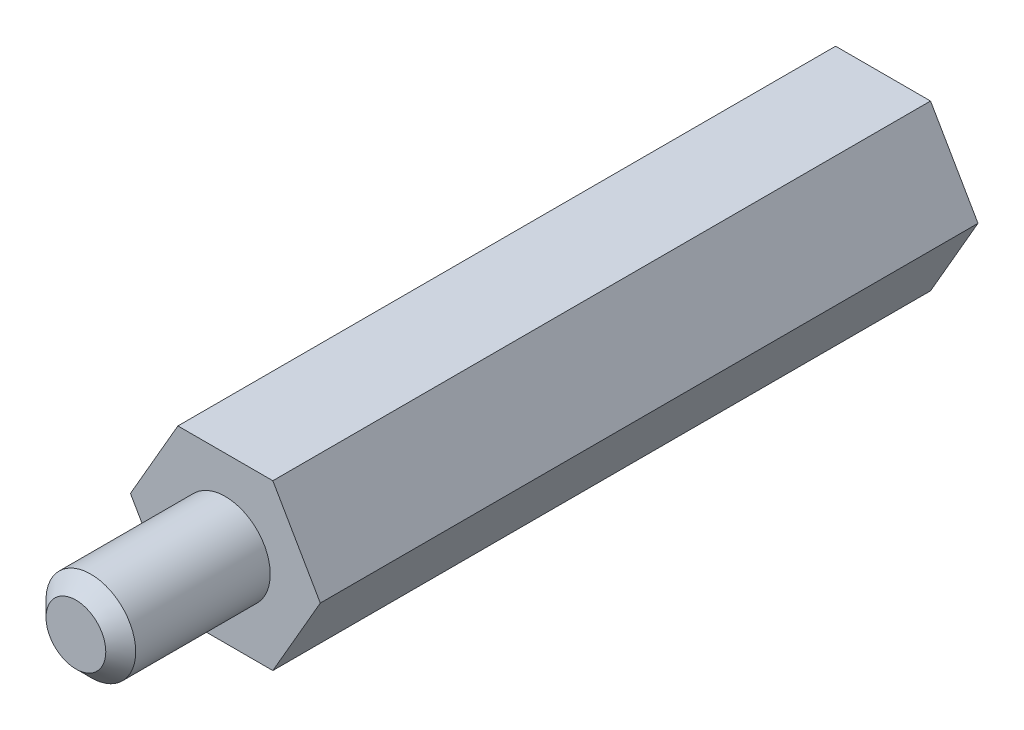
ISO-10303-21;
HEADER;
FILE_DESCRIPTION(('STEP AP214'),'2;1');
FILE_NAME('part.step','',(''),(''),'','','');
FILE_SCHEMA(('AUTOMOTIVE_DESIGN { 1 0 10303 214 1 1 1 1 }'));
ENDSEC;
DATA;
#1=APPLICATION_CONTEXT('core data for automotive mechanical design processes');
#2=APPLICATION_PROTOCOL_DEFINITION('international standard','automotive_design',2000,#1);
#3=PRODUCT_CONTEXT('',#1,'mechanical');
#4=PRODUCT('Part','Part','',(#3));
#5=PRODUCT_RELATED_PRODUCT_CATEGORY('part','',(#4));
#6=PRODUCT_DEFINITION_FORMATION('','',#4);
#7=PRODUCT_DEFINITION_CONTEXT('part definition',#1,'design');
#8=PRODUCT_DEFINITION('design','',#6,#7);
#9=PRODUCT_DEFINITION_SHAPE('','',#8);
#10=(LENGTH_UNIT() NAMED_UNIT(*) SI_UNIT(.MILLI.,.METRE.));
#11=(NAMED_UNIT(*) PLANE_ANGLE_UNIT() SI_UNIT($,.RADIAN.));
#12=(NAMED_UNIT(*) SI_UNIT($,.STERADIAN.) SOLID_ANGLE_UNIT());
#13=UNCERTAINTY_MEASURE_WITH_UNIT(LENGTH_MEASURE(1.E-05),#10,'distance_accuracy_value','');
#14=(GEOMETRIC_REPRESENTATION_CONTEXT(3) GLOBAL_UNCERTAINTY_ASSIGNED_CONTEXT((#13)) GLOBAL_UNIT_ASSIGNED_CONTEXT((#10,
#11,#12)) REPRESENTATION_CONTEXT('',''));
#15=CARTESIAN_POINT('',(0.,0.,0.));
#16=DIRECTION('',(0.,0.,1.));
#17=DIRECTION('',(1.,0.,0.));
#18=AXIS2_PLACEMENT_3D('',#15,#16,#17);
#19=CARTESIAN_POINT('',(1.58771324027146,-2.75000000000001,22.));
#20=DIRECTION('',(-0.866025403784438,0.5,0.));
#21=DIRECTION('',(-0.5,-0.866025403784439,0.));
#22=AXIS2_PLACEMENT_3D('',#19,#20,#21);
#23=PLANE('',#22);
#24=DIRECTION('',(0.5,0.866025403784439,0.));
#25=VECTOR('',#24,1.);
#26=CARTESIAN_POINT('',(1.58771324027146,-2.75000000000001,0.));
#27=LINE('',#26,#25);
#28=CARTESIAN_POINT('',(1.58771324027146,-2.75000000000001,0.));
#29=VERTEX_POINT('',#28);
#30=CARTESIAN_POINT('',(3.17542648054294,0.,0.));
#31=VERTEX_POINT('',#30);
#32=EDGE_CURVE('E122',#29,#31,#27,.T.);
#33=ORIENTED_EDGE('',*,*,#32,.T.);
#34=DIRECTION('',(0.,0.,-1.));
#35=VECTOR('',#34,1.);
#36=CARTESIAN_POINT('',(3.17542648054294,0.,22.));
#37=LINE('',#36,#35);
#38=CARTESIAN_POINT('',(3.17542648054294,0.,22.));
#39=VERTEX_POINT('',#38);
#40=EDGE_CURVE('E140',#39,#31,#37,.T.);
#41=ORIENTED_EDGE('',*,*,#40,.F.);
#42=DIRECTION('',(0.5,0.866025403784439,0.));
#43=VECTOR('',#42,1.);
#44=CARTESIAN_POINT('',(1.58771324027146,-2.75000000000001,22.));
#45=LINE('',#44,#43);
#46=CARTESIAN_POINT('',(1.58771324027146,-2.75000000000001,22.));
#47=VERTEX_POINT('',#46);
#48=EDGE_CURVE('E133',#47,#39,#45,.T.);
#49=ORIENTED_EDGE('',*,*,#48,.F.);
#50=DIRECTION('',(0.,0.,-1.));
#51=VECTOR('',#50,1.);
#52=CARTESIAN_POINT('',(1.58771324027146,-2.75000000000001,22.));
#53=LINE('',#52,#51);
#54=EDGE_CURVE('E118',#47,#29,#53,.T.);
#55=ORIENTED_EDGE('',*,*,#54,.T.);
#56=EDGE_LOOP('',(#33,#41,#49,#55));
#57=FACE_BOUND('',#56,.T.);
#58=ADVANCED_FACE('F36',(#57),#23,.F.);
#59=CARTESIAN_POINT('',(3.17542648054294,0.,22.));
#60=DIRECTION('',(-0.866025403784439,-0.499999999999999,0.));
#61=DIRECTION('',(0.499999999999999,-0.866025403784439,0.));
#62=AXIS2_PLACEMENT_3D('',#59,#60,#61);
#63=PLANE('',#62);
#64=DIRECTION('',(-0.499999999999999,0.866025403784439,0.));
#65=VECTOR('',#64,1.);
#66=CARTESIAN_POINT('',(3.17542648054294,0.,0.));
#67=LINE('',#66,#65);
#68=CARTESIAN_POINT('',(1.58771324027146,2.75000000000002,0.));
#69=VERTEX_POINT('',#68);
#70=EDGE_CURVE('E125',#31,#69,#67,.T.);
#71=ORIENTED_EDGE('',*,*,#70,.T.);
#72=DIRECTION('',(0.,0.,-1.));
#73=VECTOR('',#72,1.);
#74=CARTESIAN_POINT('',(1.58771324027146,2.75000000000002,22.));
#75=LINE('',#74,#73);
#76=CARTESIAN_POINT('',(1.58771324027146,2.75000000000002,22.));
#77=VERTEX_POINT('',#76);
#78=EDGE_CURVE('E137',#77,#69,#75,.T.);
#79=ORIENTED_EDGE('',*,*,#78,.F.);
#80=DIRECTION('',(-0.499999999999999,0.866025403784439,0.));
#81=VECTOR('',#80,1.);
#82=CARTESIAN_POINT('',(3.17542648054294,0.,22.));
#83=LINE('',#82,#81);
#84=EDGE_CURVE('E91',#39,#77,#83,.T.);
#85=ORIENTED_EDGE('',*,*,#84,.F.);
#86=ORIENTED_EDGE('',*,*,#40,.T.);
#87=EDGE_LOOP('',(#71,#79,#85,#86));
#88=FACE_BOUND('',#87,.T.);
#89=ADVANCED_FACE('F160',(#88),#63,.F.);
#90=CARTESIAN_POINT('',(1.58771324027146,2.75000000000002,22.));
#91=DIRECTION('',(0.,-1.,0.));
#92=DIRECTION('',(0.,0.,-1.));
#93=AXIS2_PLACEMENT_3D('',#90,#91,#92);
#94=PLANE('',#93);
#95=DIRECTION('',(-1.,0.,0.));
#96=VECTOR('',#95,1.);
#97=CARTESIAN_POINT('',(1.58771324027146,2.75000000000002,0.));
#98=LINE('',#97,#96);
#99=CARTESIAN_POINT('',(-1.58771324027147,2.75000000000002,0.));
#100=VERTEX_POINT('',#99);
#101=EDGE_CURVE('E128',#69,#100,#98,.T.);
#102=ORIENTED_EDGE('',*,*,#101,.T.);
#103=DIRECTION('',(0.,0.,-1.));
#104=VECTOR('',#103,1.);
#105=CARTESIAN_POINT('',(-1.58771324027147,2.75000000000002,22.));
#106=LINE('',#105,#104);
#107=CARTESIAN_POINT('',(-1.58771324027147,2.75000000000002,22.));
#108=VERTEX_POINT('',#107);
#109=EDGE_CURVE('E113',#108,#100,#106,.T.);
#110=ORIENTED_EDGE('',*,*,#109,.F.);
#111=DIRECTION('',(-1.,0.,0.));
#112=VECTOR('',#111,1.);
#113=CARTESIAN_POINT('',(1.58771324027146,2.75000000000002,22.));
#114=LINE('',#113,#112);
#115=EDGE_CURVE('E104',#77,#108,#114,.T.);
#116=ORIENTED_EDGE('',*,*,#115,.F.);
#117=ORIENTED_EDGE('',*,*,#78,.T.);
#118=EDGE_LOOP('',(#102,#110,#116,#117));
#119=FACE_BOUND('',#118,.T.);
#120=ADVANCED_FACE('F165',(#119),#94,.F.);
#121=CARTESIAN_POINT('',(-1.58771324027147,2.75000000000002,22.));
#122=DIRECTION('',(0.866025403784438,-0.500000000000001,0.));
#123=DIRECTION('',(0.500000000000001,0.866025403784438,0.));
#124=AXIS2_PLACEMENT_3D('',#121,#122,#123);
#125=PLANE('',#124);
#126=DIRECTION('',(-0.500000000000001,-0.866025403784438,0.));
#127=VECTOR('',#126,1.);
#128=CARTESIAN_POINT('',(-1.58771324027147,2.75000000000002,0.));
#129=LINE('',#128,#127);
#130=CARTESIAN_POINT('',(-3.17542648054296,0.,0.));
#131=VERTEX_POINT('',#130);
#132=EDGE_CURVE('E112',#100,#131,#129,.T.);
#133=ORIENTED_EDGE('',*,*,#132,.T.);
#134=DIRECTION('',(0.,0.,-1.));
#135=VECTOR('',#134,1.);
#136=CARTESIAN_POINT('',(-3.17542648054296,0.,22.));
#137=LINE('',#136,#135);
#138=CARTESIAN_POINT('',(-3.17542648054296,0.,22.));
#139=VERTEX_POINT('',#138);
#140=EDGE_CURVE('E109',#139,#131,#137,.T.);
#141=ORIENTED_EDGE('',*,*,#140,.F.);
#142=DIRECTION('',(-0.500000000000001,-0.866025403784438,0.));
#143=VECTOR('',#142,1.);
#144=CARTESIAN_POINT('',(-1.58771324027147,2.75000000000002,22.));
#145=LINE('',#144,#143);
#146=EDGE_CURVE('E98',#108,#139,#145,.T.);
#147=ORIENTED_EDGE('',*,*,#146,.F.);
#148=ORIENTED_EDGE('',*,*,#109,.T.);
#149=EDGE_LOOP('',(#133,#141,#147,#148));
#150=FACE_BOUND('',#149,.T.);
#151=ADVANCED_FACE('F110',(#150),#125,.F.);
#152=CARTESIAN_POINT('',(-3.17542648054296,0.,22.));
#153=DIRECTION('',(0.866025403784438,0.500000000000001,0.));
#154=DIRECTION('',(-0.500000000000001,0.866025403784438,0.));
#155=AXIS2_PLACEMENT_3D('',#152,#153,#154);
#156=PLANE('',#155);
#157=DIRECTION('',(0.500000000000001,-0.866025403784438,0.));
#158=VECTOR('',#157,1.);
#159=CARTESIAN_POINT('',(-3.17542648054296,0.,0.));
#160=LINE('',#159,#158);
#161=CARTESIAN_POINT('',(-1.58771324027148,-2.75000000000001,0.));
#162=VERTEX_POINT('',#161);
#163=EDGE_CURVE('E76',#131,#162,#160,.T.);
#164=ORIENTED_EDGE('',*,*,#163,.T.);
#165=DIRECTION('',(0.,0.,-1.));
#166=VECTOR('',#165,1.);
#167=CARTESIAN_POINT('',(-1.58771324027148,-2.75000000000001,22.));
#168=LINE('',#167,#166);
#169=CARTESIAN_POINT('',(-1.58771324027148,-2.75000000000001,22.));
#170=VERTEX_POINT('',#169);
#171=EDGE_CURVE('E114',#170,#162,#168,.T.);
#172=ORIENTED_EDGE('',*,*,#171,.F.);
#173=DIRECTION('',(0.500000000000001,-0.866025403784438,0.));
#174=VECTOR('',#173,1.);
#175=CARTESIAN_POINT('',(-3.17542648054296,0.,22.));
#176=LINE('',#175,#174);
#177=EDGE_CURVE('E102',#139,#170,#176,.T.);
#178=ORIENTED_EDGE('',*,*,#177,.F.);
#179=ORIENTED_EDGE('',*,*,#140,.T.);
#180=EDGE_LOOP('',(#164,#172,#178,#179));
#181=FACE_BOUND('',#180,.T.);
#182=ADVANCED_FACE('F116',(#181),#156,.F.);
#183=CARTESIAN_POINT('',(-1.58771324027148,-2.75000000000001,22.));
#184=DIRECTION('',(0.,1.,0.));
#185=DIRECTION('',(0.,0.,1.));
#186=AXIS2_PLACEMENT_3D('',#183,#184,#185);
#187=PLANE('',#186);
#188=DIRECTION('',(1.,0.,0.));
#189=VECTOR('',#188,1.);
#190=CARTESIAN_POINT('',(-1.58771324027148,-2.75000000000001,0.));
#191=LINE('',#190,#189);
#192=EDGE_CURVE('E82',#162,#29,#191,.T.);
#193=ORIENTED_EDGE('',*,*,#192,.T.);
#194=ORIENTED_EDGE('',*,*,#54,.F.);
#195=DIRECTION('',(1.,0.,0.));
#196=VECTOR('',#195,1.);
#197=CARTESIAN_POINT('',(-1.58771324027148,-2.75000000000001,22.));
#198=LINE('',#197,#196);
#199=EDGE_CURVE('E53',#170,#47,#198,.T.);
#200=ORIENTED_EDGE('',*,*,#199,.F.);
#201=ORIENTED_EDGE('',*,*,#171,.T.);
#202=EDGE_LOOP('',(#193,#194,#200,#201));
#203=FACE_BOUND('',#202,.T.);
#204=ADVANCED_FACE('F175',(#203),#187,.F.);
#205=CARTESIAN_POINT('',(0.,0.,22.));
#206=DIRECTION('',(0.,0.,1.));
#207=DIRECTION('',(1.,0.,0.));
#208=AXIS2_PLACEMENT_3D('',#205,#206,#207);
#209=PLANE('',#208);
#210=CARTESIAN_POINT('',(0.,0.,22.));
#211=DIRECTION('',(0.,0.,1.));
#212=DIRECTION('',(1.,0.,0.));
#213=AXIS2_PLACEMENT_3D('',#210,#211,#212);
#214=CIRCLE('',#213,1.5);
#215=CARTESIAN_POINT('',(1.5,0.,22.));
#216=VERTEX_POINT('',#215);
#217=EDGE_CURVE('E126',#216,#216,#214,.T.);
#218=ORIENTED_EDGE('',*,*,#217,.F.);
#219=EDGE_LOOP('',(#218));
#220=FACE_BOUND('',#219,.T.);
#221=ORIENTED_EDGE('',*,*,#48,.T.);
#222=ORIENTED_EDGE('',*,*,#84,.T.);
#223=ORIENTED_EDGE('',*,*,#115,.T.);
#224=ORIENTED_EDGE('',*,*,#146,.T.);
#225=ORIENTED_EDGE('',*,*,#177,.T.);
#226=ORIENTED_EDGE('',*,*,#199,.T.);
#227=EDGE_LOOP('',(#221,#222,#223,#224,#225,#226));
#228=FACE_BOUND('',#227,.T.);
#229=ADVANCED_FACE('F100',(#220,#228),#209,.T.);
#230=CARTESIAN_POINT('',(0.,0.,0.));
#231=DIRECTION('',(0.,0.,1.));
#232=DIRECTION('',(1.,0.,0.));
#233=AXIS2_PLACEMENT_3D('',#230,#231,#232);
#234=PLANE('',#233);
#235=CARTESIAN_POINT('',(0.,0.,0.));
#236=DIRECTION('',(0.,0.,-1.));
#237=DIRECTION('',(-1.,0.,0.));
#238=AXIS2_PLACEMENT_3D('',#235,#236,#237);
#239=CIRCLE('',#238,1.5);
#240=CARTESIAN_POINT('',(-1.5,0.,0.));
#241=VERTEX_POINT('',#240);
#242=EDGE_CURVE('E195',#241,#241,#239,.T.);
#243=ORIENTED_EDGE('',*,*,#242,.F.);
#244=EDGE_LOOP('',(#243));
#245=FACE_BOUND('',#244,.T.);
#246=ORIENTED_EDGE('',*,*,#32,.F.);
#247=ORIENTED_EDGE('',*,*,#192,.F.);
#248=ORIENTED_EDGE('',*,*,#163,.F.);
#249=ORIENTED_EDGE('',*,*,#132,.F.);
#250=ORIENTED_EDGE('',*,*,#101,.F.);
#251=ORIENTED_EDGE('',*,*,#70,.F.);
#252=EDGE_LOOP('',(#246,#247,#248,#249,#250,#251));
#253=FACE_BOUND('',#252,.T.);
#254=ADVANCED_FACE('F178',(#245,#253),#234,.F.);
#255=CARTESIAN_POINT('',(0.,0.,27.));
#256=DIRECTION('',(0.,0.,-1.));
#257=DIRECTION('',(-1.,0.,0.));
#258=AXIS2_PLACEMENT_3D('',#255,#256,#257);
#259=CYLINDRICAL_SURFACE('',#258,1.5);
#260=CARTESIAN_POINT('',(0.,0.,26.5));
#261=DIRECTION('',(0.,0.,1.));
#262=DIRECTION('',(1.,0.,0.));
#263=AXIS2_PLACEMENT_3D('',#260,#261,#262);
#264=CIRCLE('',#263,1.5);
#265=CARTESIAN_POINT('',(1.5,0.,26.5));
#266=VERTEX_POINT('',#265);
#267=EDGE_CURVE('E11',#266,#266,#264,.F.);
#268=ORIENTED_EDGE('',*,*,#267,.T.);
#269=EDGE_LOOP('',(#268));
#270=FACE_BOUND('',#269,.T.);
#271=ORIENTED_EDGE('',*,*,#217,.T.);
#272=EDGE_LOOP('',(#271));
#273=FACE_BOUND('',#272,.T.);
#274=ADVANCED_FACE('F156',(#270,#273),#259,.T.);
#275=CARTESIAN_POINT('',(0.,0.,27.));
#276=DIRECTION('',(0.,0.,1.));
#277=DIRECTION('',(1.,0.,0.));
#278=AXIS2_PLACEMENT_3D('',#275,#276,#277);
#279=PLANE('',#278);
#280=CARTESIAN_POINT('',(0.,0.,27.));
#281=DIRECTION('',(0.,0.,1.));
#282=DIRECTION('',(1.,0.,0.));
#283=AXIS2_PLACEMENT_3D('',#280,#281,#282);
#284=CIRCLE('',#283,0.999999999999994);
#285=CARTESIAN_POINT('',(0.999999999999994,0.,27.));
#286=VERTEX_POINT('',#285);
#287=EDGE_CURVE('E45',#286,#286,#284,.T.);
#288=ORIENTED_EDGE('',*,*,#287,.T.);
#289=EDGE_LOOP('',(#288));
#290=FACE_BOUND('',#289,.T.);
#291=ADVANCED_FACE('F144',(#290),#279,.T.);
#292=CARTESIAN_POINT('',(0.,0.,27.));
#293=DIRECTION('',(0.,0.,-1.));
#294=DIRECTION('',(-1.,0.,0.));
#295=AXIS2_PLACEMENT_3D('',#292,#293,#294);
#296=CONICAL_SURFACE('',#295,0.999999999999994,0.785398163397451);
#297=ORIENTED_EDGE('',*,*,#267,.F.);
#298=EDGE_LOOP('',(#297));
#299=FACE_BOUND('',#298,.T.);
#300=ORIENTED_EDGE('',*,*,#287,.F.);
#301=EDGE_LOOP('',(#300));
#302=FACE_BOUND('',#301,.T.);
#303=ADVANCED_FACE('F38',(#299,#302),#296,.T.);
#304=CARTESIAN_POINT('',(0.,0.,10.));
#305=DIRECTION('',(0.,0.,-1.));
#306=DIRECTION('',(-1.,0.,0.));
#307=AXIS2_PLACEMENT_3D('',#304,#305,#306);
#308=CYLINDRICAL_SURFACE('',#307,1.5);
#309=CARTESIAN_POINT('',(0.,0.,10.));
#310=DIRECTION('',(0.,0.,-1.));
#311=DIRECTION('',(-1.,0.,0.));
#312=AXIS2_PLACEMENT_3D('',#309,#310,#311);
#313=CIRCLE('',#312,1.5);
#314=CARTESIAN_POINT('',(-1.5,0.,10.));
#315=VERTEX_POINT('',#314);
#316=EDGE_CURVE('E194',#315,#315,#313,.T.);
#317=ORIENTED_EDGE('',*,*,#316,.F.);
#318=EDGE_LOOP('',(#317));
#319=FACE_BOUND('',#318,.T.);
#320=ORIENTED_EDGE('',*,*,#242,.T.);
#321=EDGE_LOOP('',(#320));
#322=FACE_BOUND('',#321,.T.);
#323=ADVANCED_FACE('F147',(#319,#322),#308,.F.);
#324=CARTESIAN_POINT('',(0.,0.,10.));
#325=DIRECTION('',(0.,0.,-1.));
#326=DIRECTION('',(-1.,0.,0.));
#327=AXIS2_PLACEMENT_3D('',#324,#325,#326);
#328=PLANE('',#327);
#329=ORIENTED_EDGE('',*,*,#316,.T.);
#330=EDGE_LOOP('',(#329));
#331=FACE_BOUND('',#330,.T.);
#332=ADVANCED_FACE('F153',(#331),#328,.T.);
#333=CLOSED_SHELL('',(#58,#89,#120,#151,#182,#204,#229,#254,#274,#291,#303,#323,#332));
#334=MANIFOLD_SOLID_BREP('B2',#333);
#335=ADVANCED_BREP_SHAPE_REPRESENTATION('',(#18,#334),#14);
#336=SHAPE_DEFINITION_REPRESENTATION(#9,#335);
ENDSEC;
END-ISO-10303-21;
